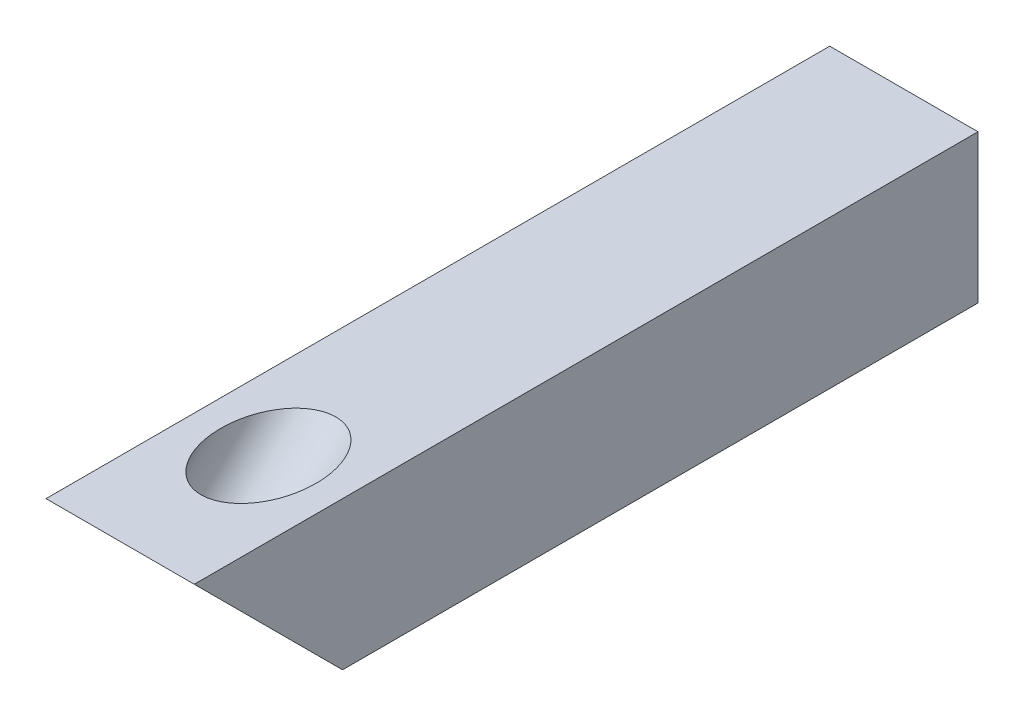
ISO-10303-21;
HEADER;
FILE_DESCRIPTION(('STEP AP214'),'2;1');
FILE_NAME('part.step','',(''),(''),'','','');
FILE_SCHEMA(('AUTOMOTIVE_DESIGN { 1 0 10303 214 1 1 1 1 }'));
ENDSEC;
DATA;
#1=APPLICATION_CONTEXT('core data for automotive mechanical design processes');
#2=APPLICATION_PROTOCOL_DEFINITION('international standard','automotive_design',2000,#1);
#3=PRODUCT_CONTEXT('',#1,'mechanical');
#4=PRODUCT('Part','Part','',(#3));
#5=PRODUCT_RELATED_PRODUCT_CATEGORY('part','',(#4));
#6=PRODUCT_DEFINITION_FORMATION('','',#4);
#7=PRODUCT_DEFINITION_CONTEXT('part definition',#1,'design');
#8=PRODUCT_DEFINITION('design','',#6,#7);
#9=PRODUCT_DEFINITION_SHAPE('','',#8);
#10=(LENGTH_UNIT() NAMED_UNIT(*) SI_UNIT(.MILLI.,.METRE.));
#11=(NAMED_UNIT(*) PLANE_ANGLE_UNIT() SI_UNIT($,.RADIAN.));
#12=(NAMED_UNIT(*) SI_UNIT($,.STERADIAN.) SOLID_ANGLE_UNIT());
#13=UNCERTAINTY_MEASURE_WITH_UNIT(LENGTH_MEASURE(1.E-05),#10,'distance_accuracy_value','');
#14=(GEOMETRIC_REPRESENTATION_CONTEXT(3) GLOBAL_UNCERTAINTY_ASSIGNED_CONTEXT((#13)) GLOBAL_UNIT_ASSIGNED_CONTEXT((#10,
#11,#12)) REPRESENTATION_CONTEXT('',''));
#15=CARTESIAN_POINT('',(0.,0.,0.));
#16=DIRECTION('',(0.,0.,1.));
#17=DIRECTION('',(1.,0.,0.));
#18=AXIS2_PLACEMENT_3D('',#15,#16,#17);
#19=CARTESIAN_POINT('',(0.,0.,20.));
#20=DIRECTION('',(1.,0.,0.));
#21=DIRECTION('',(0.,1.,0.));
#22=AXIS2_PLACEMENT_3D('',#19,#20,#21);
#23=PLANE('',#22);
#24=DIRECTION('',(0.,0.,-1.));
#25=VECTOR('',#24,1.);
#26=CARTESIAN_POINT('',(0.,7.,20.));
#27=LINE('',#26,#25);
#28=CARTESIAN_POINT('',(0.,7.,27.));
#29=VERTEX_POINT('',#28);
#30=CARTESIAN_POINT('',(0.,7.,-10.));
#31=VERTEX_POINT('',#30);
#32=EDGE_CURVE('E104',#29,#31,#27,.T.);
#33=ORIENTED_EDGE('',*,*,#32,.T.);
#34=DIRECTION('',(0.,1.,0.));
#35=VECTOR('',#34,1.);
#36=CARTESIAN_POINT('',(0.,0.,-10.));
#37=LINE('',#36,#35);
#38=CARTESIAN_POINT('',(0.,0.,-10.));
#39=VERTEX_POINT('',#38);
#40=EDGE_CURVE('E81',#39,#31,#37,.T.);
#41=ORIENTED_EDGE('',*,*,#40,.F.);
#42=DIRECTION('',(0.,0.,-1.));
#43=VECTOR('',#42,1.);
#44=CARTESIAN_POINT('',(0.,0.,20.));
#45=LINE('',#44,#43);
#46=CARTESIAN_POINT('',(0.,0.,20.));
#47=VERTEX_POINT('',#46);
#48=EDGE_CURVE('E11',#47,#39,#45,.T.);
#49=ORIENTED_EDGE('',*,*,#48,.F.);
#50=DIRECTION('',(0.,-0.707106781186548,-0.707106781186548));
#51=VECTOR('',#50,1.);
#52=CARTESIAN_POINT('',(0.,7.,27.));
#53=LINE('',#52,#51);
#54=EDGE_CURVE('E96',#29,#47,#53,.T.);
#55=ORIENTED_EDGE('',*,*,#54,.F.);
#56=EDGE_LOOP('',(#33,#41,#49,#55));
#57=FACE_BOUND('',#56,.T.);
#58=ADVANCED_FACE('F33',(#57),#23,.F.);
#59=CARTESIAN_POINT('',(0.,0.,20.));
#60=DIRECTION('',(0.,1.,0.));
#61=DIRECTION('',(0.,0.,1.));
#62=AXIS2_PLACEMENT_3D('',#59,#60,#61);
#63=PLANE('',#62);
#64=ORIENTED_EDGE('',*,*,#48,.T.);
#65=DIRECTION('',(-1.,0.,0.));
#66=VECTOR('',#65,1.);
#67=CARTESIAN_POINT('',(7.,0.,-10.));
#68=LINE('',#67,#66);
#69=CARTESIAN_POINT('',(7.,0.,-10.));
#70=VERTEX_POINT('',#69);
#71=EDGE_CURVE('E76',#70,#39,#68,.T.);
#72=ORIENTED_EDGE('',*,*,#71,.F.);
#73=DIRECTION('',(0.,0.,-1.));
#74=VECTOR('',#73,1.);
#75=CARTESIAN_POINT('',(7.,0.,20.));
#76=LINE('',#75,#74);
#77=CARTESIAN_POINT('',(7.,0.,20.));
#78=VERTEX_POINT('',#77);
#79=EDGE_CURVE('E40',#78,#70,#76,.T.);
#80=ORIENTED_EDGE('',*,*,#79,.F.);
#81=DIRECTION('',(1.,0.,0.));
#82=VECTOR('',#81,1.);
#83=CARTESIAN_POINT('',(0.,0.,20.));
#84=LINE('',#83,#82);
#85=EDGE_CURVE('E49',#47,#78,#84,.T.);
#86=ORIENTED_EDGE('',*,*,#85,.F.);
#87=EDGE_LOOP('',(#64,#72,#80,#86));
#88=FACE_BOUND('',#87,.T.);
#89=ADVANCED_FACE('F77',(#88),#63,.F.);
#90=CARTESIAN_POINT('',(7.,0.,20.));
#91=DIRECTION('',(-1.,0.,0.));
#92=DIRECTION('',(0.,-1.,0.));
#93=AXIS2_PLACEMENT_3D('',#90,#91,#92);
#94=PLANE('',#93);
#95=ORIENTED_EDGE('',*,*,#79,.T.);
#96=DIRECTION('',(0.,-1.,0.));
#97=VECTOR('',#96,1.);
#98=CARTESIAN_POINT('',(7.,0.,-10.));
#99=LINE('',#98,#97);
#100=CARTESIAN_POINT('',(7.,7.,-10.));
#101=VERTEX_POINT('',#100);
#102=EDGE_CURVE('E71',#101,#70,#99,.T.);
#103=ORIENTED_EDGE('',*,*,#102,.F.);
#104=DIRECTION('',(0.,0.,-1.));
#105=VECTOR('',#104,1.);
#106=CARTESIAN_POINT('',(7.,7.,20.));
#107=LINE('',#106,#105);
#108=CARTESIAN_POINT('',(7.,7.,27.));
#109=VERTEX_POINT('',#108);
#110=EDGE_CURVE('E74',#109,#101,#107,.T.);
#111=ORIENTED_EDGE('',*,*,#110,.F.);
#112=DIRECTION('',(0.,-0.707106781186548,-0.707106781186548));
#113=VECTOR('',#112,1.);
#114=CARTESIAN_POINT('',(7.,7.,27.));
#115=LINE('',#114,#113);
#116=EDGE_CURVE('E73',#109,#78,#115,.T.);
#117=ORIENTED_EDGE('',*,*,#116,.T.);
#118=EDGE_LOOP('',(#95,#103,#111,#117));
#119=FACE_BOUND('',#118,.T.);
#120=ADVANCED_FACE('F69',(#119),#94,.F.);
#121=CARTESIAN_POINT('',(0.,7.,20.));
#122=DIRECTION('',(0.,-1.,0.));
#123=DIRECTION('',(0.,0.,-1.));
#124=AXIS2_PLACEMENT_3D('',#121,#122,#123);
#125=PLANE('',#124);
#126=CARTESIAN_POINT('',(3.5,7.,20.));
#127=DIRECTION('',(0.,-1.,0.));
#128=DIRECTION('',(0.,0.,1.));
#129=AXIS2_PLACEMENT_3D('',#126,#127,#128);
#130=ELLIPSE('',#129,3.18198051533947,2.25);
#131=CARTESIAN_POINT('',(3.5,7.,23.1819805153395));
#132=VERTEX_POINT('',#131);
#133=EDGE_CURVE('E87',#132,#132,#130,.T.);
#134=ORIENTED_EDGE('',*,*,#133,.T.);
#135=EDGE_LOOP('',(#134));
#136=FACE_BOUND('',#135,.T.);
#137=ORIENTED_EDGE('',*,*,#110,.T.);
#138=DIRECTION('',(1.,0.,0.));
#139=VECTOR('',#138,1.);
#140=CARTESIAN_POINT('',(7.,7.,-10.));
#141=LINE('',#140,#139);
#142=EDGE_CURVE('E86',#31,#101,#141,.T.);
#143=ORIENTED_EDGE('',*,*,#142,.F.);
#144=ORIENTED_EDGE('',*,*,#32,.F.);
#145=DIRECTION('',(1.,0.,0.));
#146=VECTOR('',#145,1.);
#147=CARTESIAN_POINT('',(0.,7.,27.));
#148=LINE('',#147,#146);
#149=EDGE_CURVE('E99',#29,#109,#148,.T.);
#150=ORIENTED_EDGE('',*,*,#149,.T.);
#151=EDGE_LOOP('',(#137,#143,#144,#150));
#152=FACE_BOUND('',#151,.T.);
#153=ADVANCED_FACE('F107',(#136,#152),#125,.F.);
#154=CARTESIAN_POINT('',(0.,7.,27.));
#155=DIRECTION('',(0.,-0.707106781186548,0.707106781186548));
#156=DIRECTION('',(0.,-0.707106781186548,-0.707106781186548));
#157=AXIS2_PLACEMENT_3D('',#154,#155,#156);
#158=PLANE('',#157);
#159=CARTESIAN_POINT('',(3.5,3.5,23.5));
#160=DIRECTION('',(0.,-0.707106781186548,0.707106781186547));
#161=DIRECTION('',(0.,-0.707106781186547,-0.707106781186548));
#162=AXIS2_PLACEMENT_3D('',#159,#160,#161);
#163=CIRCLE('',#162,2.25);
#164=CARTESIAN_POINT('',(3.5,1.90900974233026,21.9090097423303));
#165=VERTEX_POINT('',#164);
#166=EDGE_CURVE('E90',#165,#165,#163,.T.);
#167=ORIENTED_EDGE('',*,*,#166,.F.);
#168=EDGE_LOOP('',(#167));
#169=FACE_BOUND('',#168,.T.);
#170=ORIENTED_EDGE('',*,*,#116,.F.);
#171=ORIENTED_EDGE('',*,*,#149,.F.);
#172=ORIENTED_EDGE('',*,*,#54,.T.);
#173=ORIENTED_EDGE('',*,*,#85,.T.);
#174=EDGE_LOOP('',(#170,#171,#172,#173));
#175=FACE_BOUND('',#174,.T.);
#176=ADVANCED_FACE('F111',(#169,#175),#158,.T.);
#177=CARTESIAN_POINT('',(0.,0.,-10.));
#178=DIRECTION('',(0.,0.,1.));
#179=DIRECTION('',(1.,0.,0.));
#180=AXIS2_PLACEMENT_3D('',#177,#178,#179);
#181=PLANE('',#180);
#182=ORIENTED_EDGE('',*,*,#102,.T.);
#183=ORIENTED_EDGE('',*,*,#71,.T.);
#184=ORIENTED_EDGE('',*,*,#40,.T.);
#185=ORIENTED_EDGE('',*,*,#142,.T.);
#186=EDGE_LOOP('',(#182,#183,#184,#185));
#187=FACE_BOUND('',#186,.T.);
#188=ADVANCED_FACE('F84',(#187),#181,.F.);
#189=CARTESIAN_POINT('',(3.49999999999999,22.,5.00000000000001));
#190=DIRECTION('',(0.,-0.707106781186548,0.707106781186548));
#191=DIRECTION('',(0.,-0.707106781186547,-0.707106781186548));
#192=AXIS2_PLACEMENT_3D('',#189,#190,#191);
#193=CYLINDRICAL_SURFACE('',#192,2.25);
#194=ORIENTED_EDGE('',*,*,#166,.T.);
#195=EDGE_LOOP('',(#194));
#196=FACE_BOUND('',#195,.T.);
#197=ORIENTED_EDGE('',*,*,#133,.F.);
#198=EDGE_LOOP('',(#197));
#199=FACE_BOUND('',#198,.T.);
#200=ADVANCED_FACE('F130',(#196,#199),#193,.F.);
#201=CLOSED_SHELL('',(#58,#89,#120,#153,#176,#188,#200));
#202=MANIFOLD_SOLID_BREP('B2',#201);
#203=ADVANCED_BREP_SHAPE_REPRESENTATION('',(#18,#202),#14);
#204=SHAPE_DEFINITION_REPRESENTATION(#9,#203);
ENDSEC;
END-ISO-10303-21;
